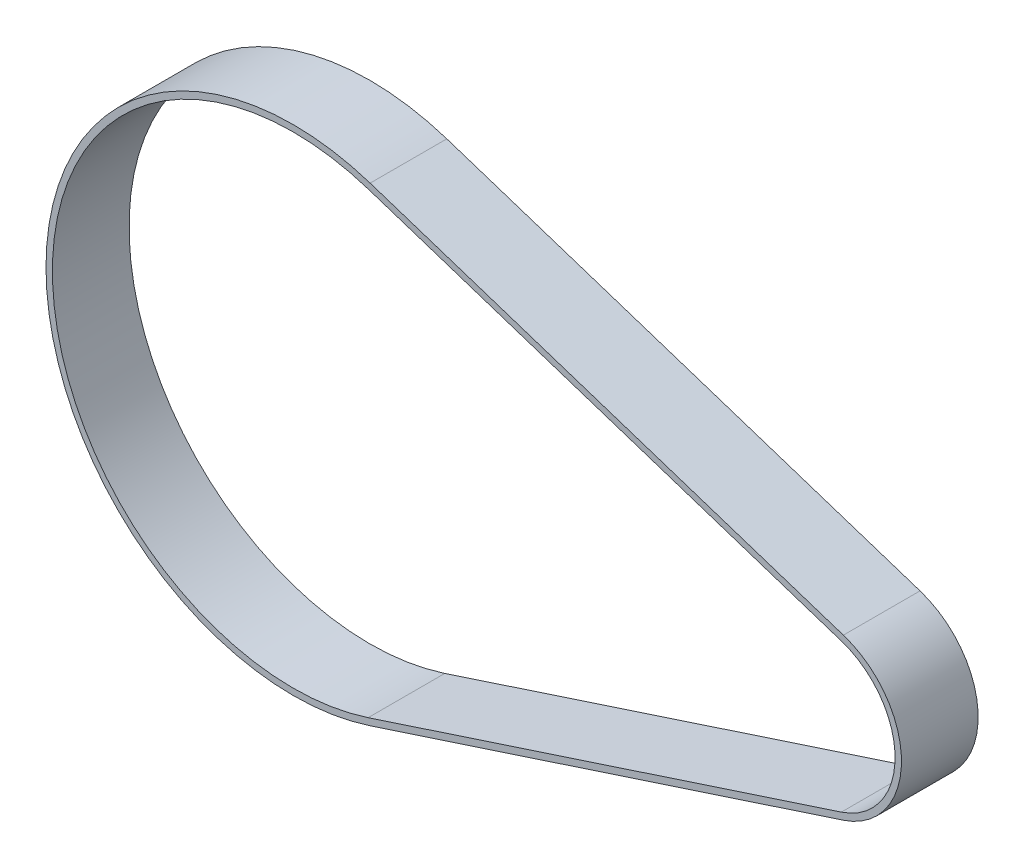
ISO-10303-21;
HEADER;
FILE_DESCRIPTION(('STEP AP214'),'2;1');
FILE_NAME('part.step','',(''),(''),'','','');
FILE_SCHEMA(('AUTOMOTIVE_DESIGN { 1 0 10303 214 1 1 1 1 }'));
ENDSEC;
DATA;
#1=APPLICATION_CONTEXT('core data for automotive mechanical design processes');
#2=APPLICATION_PROTOCOL_DEFINITION('international standard','automotive_design',2000,#1);
#3=PRODUCT_CONTEXT('',#1,'mechanical');
#4=PRODUCT('Part','Part','',(#3));
#5=PRODUCT_RELATED_PRODUCT_CATEGORY('part','',(#4));
#6=PRODUCT_DEFINITION_FORMATION('','',#4);
#7=PRODUCT_DEFINITION_CONTEXT('part definition',#1,'design');
#8=PRODUCT_DEFINITION('design','',#6,#7);
#9=PRODUCT_DEFINITION_SHAPE('','',#8);
#10=(LENGTH_UNIT() NAMED_UNIT(*) SI_UNIT(.MILLI.,.METRE.));
#11=(NAMED_UNIT(*) PLANE_ANGLE_UNIT() SI_UNIT($,.RADIAN.));
#12=(NAMED_UNIT(*) SI_UNIT($,.STERADIAN.) SOLID_ANGLE_UNIT());
#13=UNCERTAINTY_MEASURE_WITH_UNIT(LENGTH_MEASURE(1.E-05),#10,'distance_accuracy_value','');
#14=(GEOMETRIC_REPRESENTATION_CONTEXT(3) GLOBAL_UNCERTAINTY_ASSIGNED_CONTEXT((#13)) GLOBAL_UNIT_ASSIGNED_CONTEXT((#10,
#11,#12)) REPRESENTATION_CONTEXT('',''));
#15=CARTESIAN_POINT('',(0.,0.,0.));
#16=DIRECTION('',(0.,0.,1.));
#17=DIRECTION('',(1.,0.,0.));
#18=AXIS2_PLACEMENT_3D('',#15,#16,#17);
#19=CARTESIAN_POINT('',(0.,0.,6.));
#20=DIRECTION('',(0.,0.,1.));
#21=DIRECTION('',(1.,0.,0.));
#22=AXIS2_PLACEMENT_3D('',#19,#20,#21);
#23=PLANE('',#22);
#24=CARTESIAN_POINT('',(0.,0.,6.));
#25=DIRECTION('',(0.,0.,1.));
#26=DIRECTION('',(1.,0.,0.));
#27=AXIS2_PLACEMENT_3D('',#24,#25,#26);
#28=CIRCLE('',#27,19.35);
#29=CARTESIAN_POINT('',(6.01737804878049,18.3905862173574,6.));
#30=VERTEX_POINT('',#29);
#31=CARTESIAN_POINT('',(6.01737804878048,-18.3905862173574,6.));
#32=VERTEX_POINT('',#31);
#33=EDGE_CURVE('E133',#30,#32,#28,.T.);
#34=ORIENTED_EDGE('',*,*,#33,.T.);
#35=DIRECTION('',(0.95041789236989,0.310975609756098,0.));
#36=VECTOR('',#35,1.);
#37=CARTESIAN_POINT('',(43.0524390243903,-6.27275808964127,6.));
#38=LINE('',#37,#36);
#39=CARTESIAN_POINT('',(43.0524390243903,-6.27275808964126,6.));
#40=VERTEX_POINT('',#39);
#41=EDGE_CURVE('E136',#32,#40,#38,.T.);
#42=ORIENTED_EDGE('',*,*,#41,.T.);
#43=CARTESIAN_POINT('',(41.,0.,6.));
#44=DIRECTION('',(0.,0.,1.));
#45=DIRECTION('',(1.,0.,0.));
#46=AXIS2_PLACEMENT_3D('',#43,#44,#45);
#47=CIRCLE('',#46,6.59999999999999);
#48=CARTESIAN_POINT('',(43.0524390243902,6.27275808964127,6.));
#49=VERTEX_POINT('',#48);
#50=EDGE_CURVE('E139',#40,#49,#47,.T.);
#51=ORIENTED_EDGE('',*,*,#50,.T.);
#52=DIRECTION('',(-0.95041789236989,0.310975609756098,0.));
#53=VECTOR('',#52,1.);
#54=CARTESIAN_POINT('',(6.01737804878049,18.3905862173574,6.));
#55=LINE('',#54,#53);
#56=EDGE_CURVE('E141',#49,#30,#55,.T.);
#57=ORIENTED_EDGE('',*,*,#56,.T.);
#58=EDGE_LOOP('',(#34,#42,#51,#57));
#59=FACE_BOUND('',#58,.T.);
#60=DIRECTION('',(0.95041789236989,0.310975609756098,0.));
#61=VECTOR('',#60,1.);
#62=CARTESIAN_POINT('',(42.8969512195122,-5.79754914345632,6.));
#63=LINE('',#62,#61);
#64=CARTESIAN_POINT('',(5.86189024390244,-17.9153772711724,6.));
#65=VERTEX_POINT('',#64);
#66=CARTESIAN_POINT('',(42.8969512195122,-5.79754914345632,6.));
#67=VERTEX_POINT('',#66);
#68=EDGE_CURVE('E105',#65,#67,#63,.T.);
#69=ORIENTED_EDGE('',*,*,#68,.F.);
#70=CARTESIAN_POINT('',(0.,0.,6.));
#71=DIRECTION('',(0.,0.,1.));
#72=DIRECTION('',(1.,0.,0.));
#73=AXIS2_PLACEMENT_3D('',#70,#71,#72);
#74=CIRCLE('',#73,18.85);
#75=CARTESIAN_POINT('',(5.86189024390244,17.9153772711724,6.));
#76=VERTEX_POINT('',#75);
#77=EDGE_CURVE('E97',#76,#65,#74,.T.);
#78=ORIENTED_EDGE('',*,*,#77,.F.);
#79=DIRECTION('',(-0.95041789236989,0.310975609756098,0.));
#80=VECTOR('',#79,1.);
#81=CARTESIAN_POINT('',(5.86189024390244,17.9153772711724,6.));
#82=LINE('',#81,#80);
#83=CARTESIAN_POINT('',(42.8969512195122,5.79754914345632,6.));
#84=VERTEX_POINT('',#83);
#85=EDGE_CURVE('E119',#84,#76,#82,.T.);
#86=ORIENTED_EDGE('',*,*,#85,.F.);
#87=CARTESIAN_POINT('',(41.,0.,6.));
#88=DIRECTION('',(0.,0.,1.));
#89=DIRECTION('',(1.,0.,0.));
#90=AXIS2_PLACEMENT_3D('',#87,#88,#89);
#91=CIRCLE('',#90,6.09999999999999);
#92=EDGE_CURVE('E117',#67,#84,#91,.T.);
#93=ORIENTED_EDGE('',*,*,#92,.F.);
#94=EDGE_LOOP('',(#69,#78,#86,#93));
#95=FACE_BOUND('',#94,.T.);
#96=ADVANCED_FACE('F32',(#59,#95),#23,.T.);
#97=CARTESIAN_POINT('',(0.,0.,0.));
#98=DIRECTION('',(0.,0.,1.));
#99=DIRECTION('',(1.,0.,0.));
#100=AXIS2_PLACEMENT_3D('',#97,#98,#99);
#101=PLANE('',#100);
#102=CARTESIAN_POINT('',(0.,0.,0.));
#103=DIRECTION('',(0.,0.,1.));
#104=DIRECTION('',(1.,0.,0.));
#105=AXIS2_PLACEMENT_3D('',#102,#103,#104);
#106=CIRCLE('',#105,19.35);
#107=CARTESIAN_POINT('',(6.01737804878049,18.3905862173574,0.));
#108=VERTEX_POINT('',#107);
#109=CARTESIAN_POINT('',(6.01737804878048,-18.3905862173574,0.));
#110=VERTEX_POINT('',#109);
#111=EDGE_CURVE('E113',#108,#110,#106,.T.);
#112=ORIENTED_EDGE('',*,*,#111,.F.);
#113=DIRECTION('',(-0.95041789236989,0.310975609756098,0.));
#114=VECTOR('',#113,1.);
#115=CARTESIAN_POINT('',(6.01737804878049,18.3905862173574,0.));
#116=LINE('',#115,#114);
#117=CARTESIAN_POINT('',(43.0524390243902,6.27275808964127,0.));
#118=VERTEX_POINT('',#117);
#119=EDGE_CURVE('E137',#118,#108,#116,.T.);
#120=ORIENTED_EDGE('',*,*,#119,.F.);
#121=CARTESIAN_POINT('',(41.,0.,0.));
#122=DIRECTION('',(0.,0.,1.));
#123=DIRECTION('',(1.,0.,0.));
#124=AXIS2_PLACEMENT_3D('',#121,#122,#123);
#125=CIRCLE('',#124,6.59999999999999);
#126=CARTESIAN_POINT('',(43.0524390243903,-6.27275808964126,0.));
#127=VERTEX_POINT('',#126);
#128=EDGE_CURVE('E148',#127,#118,#125,.T.);
#129=ORIENTED_EDGE('',*,*,#128,.F.);
#130=DIRECTION('',(0.95041789236989,0.310975609756098,0.));
#131=VECTOR('',#130,1.);
#132=CARTESIAN_POINT('',(43.0524390243903,-6.27275808964127,0.));
#133=LINE('',#132,#131);
#134=EDGE_CURVE('E146',#110,#127,#133,.T.);
#135=ORIENTED_EDGE('',*,*,#134,.F.);
#136=EDGE_LOOP('',(#112,#120,#129,#135));
#137=FACE_BOUND('',#136,.T.);
#138=CARTESIAN_POINT('',(0.,0.,0.));
#139=DIRECTION('',(0.,0.,1.));
#140=DIRECTION('',(1.,0.,0.));
#141=AXIS2_PLACEMENT_3D('',#138,#139,#140);
#142=CIRCLE('',#141,18.85);
#143=CARTESIAN_POINT('',(5.86189024390244,17.9153772711724,0.));
#144=VERTEX_POINT('',#143);
#145=CARTESIAN_POINT('',(5.86189024390244,-17.9153772711724,0.));
#146=VERTEX_POINT('',#145);
#147=EDGE_CURVE('E55',#144,#146,#142,.T.);
#148=ORIENTED_EDGE('',*,*,#147,.T.);
#149=DIRECTION('',(0.95041789236989,0.310975609756098,0.));
#150=VECTOR('',#149,1.);
#151=CARTESIAN_POINT('',(42.8969512195122,-5.79754914345632,0.));
#152=LINE('',#151,#150);
#153=CARTESIAN_POINT('',(42.8969512195122,-5.79754914345632,0.));
#154=VERTEX_POINT('',#153);
#155=EDGE_CURVE('E112',#146,#154,#152,.T.);
#156=ORIENTED_EDGE('',*,*,#155,.T.);
#157=CARTESIAN_POINT('',(41.,0.,0.));
#158=DIRECTION('',(0.,0.,1.));
#159=DIRECTION('',(1.,0.,0.));
#160=AXIS2_PLACEMENT_3D('',#157,#158,#159);
#161=CIRCLE('',#160,6.09999999999999);
#162=CARTESIAN_POINT('',(42.8969512195122,5.79754914345632,0.));
#163=VERTEX_POINT('',#162);
#164=EDGE_CURVE('E125',#154,#163,#161,.T.);
#165=ORIENTED_EDGE('',*,*,#164,.T.);
#166=DIRECTION('',(-0.95041789236989,0.310975609756098,0.));
#167=VECTOR('',#166,1.);
#168=CARTESIAN_POINT('',(5.86189024390244,17.9153772711724,0.));
#169=LINE('',#168,#167);
#170=EDGE_CURVE('E106',#163,#144,#169,.T.);
#171=ORIENTED_EDGE('',*,*,#170,.T.);
#172=EDGE_LOOP('',(#148,#156,#165,#171));
#173=FACE_BOUND('',#172,.T.);
#174=ADVANCED_FACE('F166',(#137,#173),#101,.F.);
#175=CARTESIAN_POINT('',(0.,0.,6.));
#176=DIRECTION('',(0.,0.,-1.));
#177=DIRECTION('',(-1.,0.,0.));
#178=AXIS2_PLACEMENT_3D('',#175,#176,#177);
#179=CYLINDRICAL_SURFACE('',#178,19.35);
#180=ORIENTED_EDGE('',*,*,#111,.T.);
#181=DIRECTION('',(0.,0.,-1.));
#182=VECTOR('',#181,1.);
#183=CARTESIAN_POINT('',(6.01737804878048,-18.3905862173574,6.));
#184=LINE('',#183,#182);
#185=EDGE_CURVE('E11',#32,#110,#184,.T.);
#186=ORIENTED_EDGE('',*,*,#185,.F.);
#187=ORIENTED_EDGE('',*,*,#33,.F.);
#188=DIRECTION('',(0.,0.,-1.));
#189=VECTOR('',#188,1.);
#190=CARTESIAN_POINT('',(6.01737804878049,18.3905862173574,6.));
#191=LINE('',#190,#189);
#192=EDGE_CURVE('E143',#30,#108,#191,.T.);
#193=ORIENTED_EDGE('',*,*,#192,.T.);
#194=EDGE_LOOP('',(#180,#186,#187,#193));
#195=FACE_BOUND('',#194,.T.);
#196=ADVANCED_FACE('F34',(#195),#179,.T.);
#197=CARTESIAN_POINT('',(43.0524390243903,-6.27275808964127,6.));
#198=DIRECTION('',(-0.310975609756098,0.95041789236989,0.));
#199=DIRECTION('',(-0.95041789236989,-0.310975609756098,0.));
#200=AXIS2_PLACEMENT_3D('',#197,#198,#199);
#201=PLANE('',#200);
#202=ORIENTED_EDGE('',*,*,#134,.T.);
#203=DIRECTION('',(0.,0.,-1.));
#204=VECTOR('',#203,1.);
#205=CARTESIAN_POINT('',(43.0524390243903,-6.27275808964126,6.));
#206=LINE('',#205,#204);
#207=EDGE_CURVE('E40',#40,#127,#206,.T.);
#208=ORIENTED_EDGE('',*,*,#207,.F.);
#209=ORIENTED_EDGE('',*,*,#41,.F.);
#210=ORIENTED_EDGE('',*,*,#185,.T.);
#211=EDGE_LOOP('',(#202,#208,#209,#210));
#212=FACE_BOUND('',#211,.T.);
#213=ADVANCED_FACE('F176',(#212),#201,.F.);
#214=CARTESIAN_POINT('',(41.,0.,6.));
#215=DIRECTION('',(0.,0.,-1.));
#216=DIRECTION('',(-1.,0.,0.));
#217=AXIS2_PLACEMENT_3D('',#214,#215,#216);
#218=CYLINDRICAL_SURFACE('',#217,6.59999999999999);
#219=ORIENTED_EDGE('',*,*,#128,.T.);
#220=DIRECTION('',(0.,0.,-1.));
#221=VECTOR('',#220,1.);
#222=CARTESIAN_POINT('',(43.0524390243902,6.27275808964127,6.));
#223=LINE('',#222,#221);
#224=EDGE_CURVE('E153',#49,#118,#223,.T.);
#225=ORIENTED_EDGE('',*,*,#224,.F.);
#226=ORIENTED_EDGE('',*,*,#50,.F.);
#227=ORIENTED_EDGE('',*,*,#207,.T.);
#228=EDGE_LOOP('',(#219,#225,#226,#227));
#229=FACE_BOUND('',#228,.T.);
#230=ADVANCED_FACE('F160',(#229),#218,.T.);
#231=CARTESIAN_POINT('',(6.01737804878049,18.3905862173574,6.));
#232=DIRECTION('',(-0.310975609756098,-0.95041789236989,0.));
#233=DIRECTION('',(0.95041789236989,-0.310975609756098,0.));
#234=AXIS2_PLACEMENT_3D('',#231,#232,#233);
#235=PLANE('',#234);
#236=ORIENTED_EDGE('',*,*,#119,.T.);
#237=ORIENTED_EDGE('',*,*,#192,.F.);
#238=ORIENTED_EDGE('',*,*,#56,.F.);
#239=ORIENTED_EDGE('',*,*,#224,.T.);
#240=EDGE_LOOP('',(#236,#237,#238,#239));
#241=FACE_BOUND('',#240,.T.);
#242=ADVANCED_FACE('F170',(#241),#235,.F.);
#243=CARTESIAN_POINT('',(0.,0.,6.));
#244=DIRECTION('',(0.,0.,-1.));
#245=DIRECTION('',(-1.,0.,0.));
#246=AXIS2_PLACEMENT_3D('',#243,#244,#245);
#247=CYLINDRICAL_SURFACE('',#246,18.85);
#248=ORIENTED_EDGE('',*,*,#147,.F.);
#249=DIRECTION('',(0.,0.,-1.));
#250=VECTOR('',#249,1.);
#251=CARTESIAN_POINT('',(5.86189024390244,17.9153772711724,6.));
#252=LINE('',#251,#250);
#253=EDGE_CURVE('E101',#76,#144,#252,.T.);
#254=ORIENTED_EDGE('',*,*,#253,.F.);
#255=ORIENTED_EDGE('',*,*,#77,.T.);
#256=DIRECTION('',(0.,0.,-1.));
#257=VECTOR('',#256,1.);
#258=CARTESIAN_POINT('',(5.86189024390244,-17.9153772711724,6.));
#259=LINE('',#258,#257);
#260=EDGE_CURVE('E100',#65,#146,#259,.T.);
#261=ORIENTED_EDGE('',*,*,#260,.T.);
#262=EDGE_LOOP('',(#248,#254,#255,#261));
#263=FACE_BOUND('',#262,.T.);
#264=ADVANCED_FACE('F99',(#263),#247,.F.);
#265=CARTESIAN_POINT('',(42.8969512195122,-5.79754914345632,6.));
#266=DIRECTION('',(-0.310975609756098,0.95041789236989,0.));
#267=DIRECTION('',(-0.95041789236989,-0.310975609756098,0.));
#268=AXIS2_PLACEMENT_3D('',#265,#266,#267);
#269=PLANE('',#268);
#270=ORIENTED_EDGE('',*,*,#155,.F.);
#271=ORIENTED_EDGE('',*,*,#260,.F.);
#272=ORIENTED_EDGE('',*,*,#68,.T.);
#273=DIRECTION('',(0.,0.,-1.));
#274=VECTOR('',#273,1.);
#275=CARTESIAN_POINT('',(42.8969512195122,-5.79754914345632,6.));
#276=LINE('',#275,#274);
#277=EDGE_CURVE('E114',#67,#154,#276,.T.);
#278=ORIENTED_EDGE('',*,*,#277,.T.);
#279=EDGE_LOOP('',(#270,#271,#272,#278));
#280=FACE_BOUND('',#279,.T.);
#281=ADVANCED_FACE('F109',(#280),#269,.T.);
#282=CARTESIAN_POINT('',(41.,0.,6.));
#283=DIRECTION('',(0.,0.,-1.));
#284=DIRECTION('',(-1.,0.,0.));
#285=AXIS2_PLACEMENT_3D('',#282,#283,#284);
#286=CYLINDRICAL_SURFACE('',#285,6.09999999999999);
#287=ORIENTED_EDGE('',*,*,#164,.F.);
#288=ORIENTED_EDGE('',*,*,#277,.F.);
#289=ORIENTED_EDGE('',*,*,#92,.T.);
#290=DIRECTION('',(0.,0.,-1.));
#291=VECTOR('',#290,1.);
#292=CARTESIAN_POINT('',(42.8969512195122,5.79754914345632,6.));
#293=LINE('',#292,#291);
#294=EDGE_CURVE('E47',#84,#163,#293,.T.);
#295=ORIENTED_EDGE('',*,*,#294,.T.);
#296=EDGE_LOOP('',(#287,#288,#289,#295));
#297=FACE_BOUND('',#296,.T.);
#298=ADVANCED_FACE('F199',(#297),#286,.F.);
#299=CARTESIAN_POINT('',(5.86189024390244,17.9153772711724,6.));
#300=DIRECTION('',(-0.310975609756098,-0.95041789236989,0.));
#301=DIRECTION('',(0.95041789236989,-0.310975609756098,0.));
#302=AXIS2_PLACEMENT_3D('',#299,#300,#301);
#303=PLANE('',#302);
#304=ORIENTED_EDGE('',*,*,#170,.F.);
#305=ORIENTED_EDGE('',*,*,#294,.F.);
#306=ORIENTED_EDGE('',*,*,#85,.T.);
#307=ORIENTED_EDGE('',*,*,#253,.T.);
#308=EDGE_LOOP('',(#304,#305,#306,#307));
#309=FACE_BOUND('',#308,.T.);
#310=ADVANCED_FACE('F203',(#309),#303,.T.);
#311=CLOSED_SHELL('',(#96,#174,#196,#213,#230,#242,#264,#281,#298,#310));
#312=MANIFOLD_SOLID_BREP('B2',#311);
#313=ADVANCED_BREP_SHAPE_REPRESENTATION('',(#18,#312),#14);
#314=SHAPE_DEFINITION_REPRESENTATION(#9,#313);
ENDSEC;
END-ISO-10303-21;
